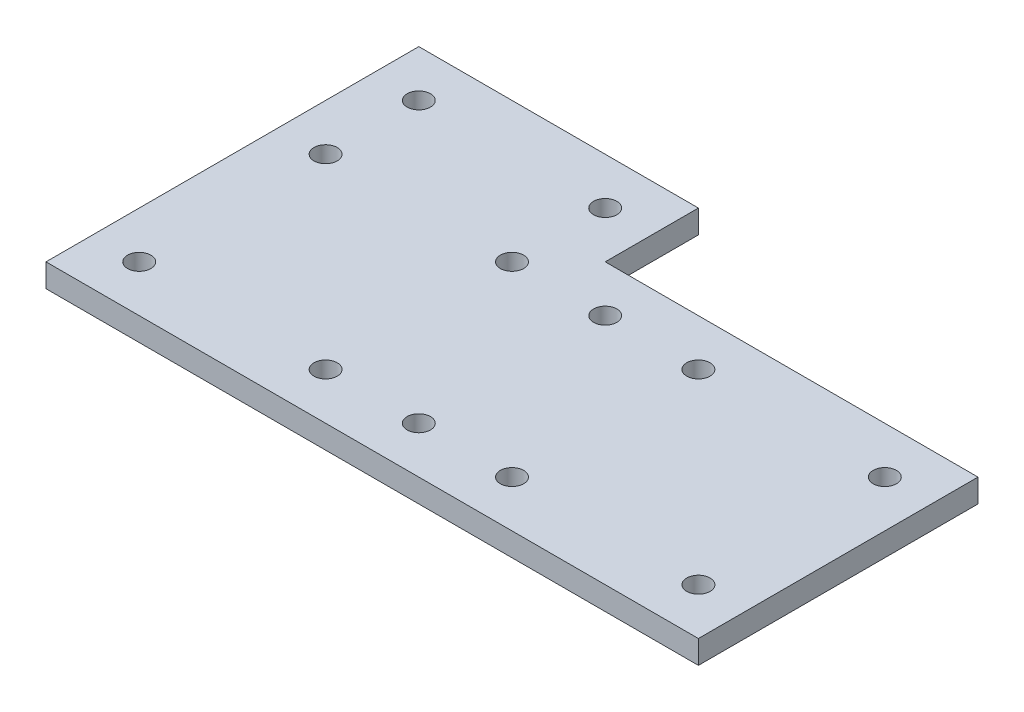
ISO-10303-21;
HEADER;
FILE_DESCRIPTION(('STEP AP214'),'2;1');
FILE_NAME('part.step','',(''),(''),'','','');
FILE_SCHEMA(('AUTOMOTIVE_DESIGN { 1 0 10303 214 1 1 1 1 }'));
ENDSEC;
DATA;
#1=APPLICATION_CONTEXT('core data for automotive mechanical design processes');
#2=APPLICATION_PROTOCOL_DEFINITION('international standard','automotive_design',2000,#1);
#3=PRODUCT_CONTEXT('',#1,'mechanical');
#4=PRODUCT('Part','Part','',(#3));
#5=PRODUCT_RELATED_PRODUCT_CATEGORY('part','',(#4));
#6=PRODUCT_DEFINITION_FORMATION('','',#4);
#7=PRODUCT_DEFINITION_CONTEXT('part definition',#1,'design');
#8=PRODUCT_DEFINITION('design','',#6,#7);
#9=PRODUCT_DEFINITION_SHAPE('','',#8);
#10=(LENGTH_UNIT() NAMED_UNIT(*) SI_UNIT(.MILLI.,.METRE.));
#11=(NAMED_UNIT(*) PLANE_ANGLE_UNIT() SI_UNIT($,.RADIAN.));
#12=(NAMED_UNIT(*) SI_UNIT($,.STERADIAN.) SOLID_ANGLE_UNIT());
#13=UNCERTAINTY_MEASURE_WITH_UNIT(LENGTH_MEASURE(1.E-05),#10,'distance_accuracy_value','');
#14=(GEOMETRIC_REPRESENTATION_CONTEXT(3) GLOBAL_UNCERTAINTY_ASSIGNED_CONTEXT((#13)) GLOBAL_UNIT_ASSIGNED_CONTEXT((#10,
#11,#12)) REPRESENTATION_CONTEXT('',''));
#15=CARTESIAN_POINT('',(0.,0.,0.));
#16=DIRECTION('',(0.,0.,1.));
#17=DIRECTION('',(1.,0.,0.));
#18=AXIS2_PLACEMENT_3D('',#15,#16,#17);
#19=CARTESIAN_POINT('',(38.1,3.175,-50.8));
#20=DIRECTION('',(0.,0.,1.));
#21=DIRECTION('',(1.,0.,0.));
#22=AXIS2_PLACEMENT_3D('',#19,#20,#21);
#23=PLANE('',#22);
#24=DIRECTION('',(-1.,0.,0.));
#25=VECTOR('',#24,1.);
#26=CARTESIAN_POINT('',(38.1,0.,-50.8));
#27=LINE('',#26,#25);
#28=CARTESIAN_POINT('',(38.1,0.,-50.8));
#29=VERTEX_POINT('',#28);
#30=CARTESIAN_POINT('',(0.,0.,-50.8));
#31=VERTEX_POINT('',#30);
#32=EDGE_CURVE('E117',#29,#31,#27,.T.);
#33=ORIENTED_EDGE('',*,*,#32,.T.);
#34=DIRECTION('',(0.,-1.,0.));
#35=VECTOR('',#34,1.);
#36=CARTESIAN_POINT('',(0.,3.175,-50.8));
#37=LINE('',#36,#35);
#38=CARTESIAN_POINT('',(0.,3.175,-50.8));
#39=VERTEX_POINT('',#38);
#40=EDGE_CURVE('E11',#39,#31,#37,.T.);
#41=ORIENTED_EDGE('',*,*,#40,.F.);
#42=DIRECTION('',(-1.,0.,0.));
#43=VECTOR('',#42,1.);
#44=CARTESIAN_POINT('',(38.1,3.175,-50.8));
#45=LINE('',#44,#43);
#46=CARTESIAN_POINT('',(38.1,3.175,-50.8));
#47=VERTEX_POINT('',#46);
#48=EDGE_CURVE('E128',#47,#39,#45,.T.);
#49=ORIENTED_EDGE('',*,*,#48,.F.);
#50=DIRECTION('',(0.,-1.,0.));
#51=VECTOR('',#50,1.);
#52=CARTESIAN_POINT('',(38.1,3.175,-50.8));
#53=LINE('',#52,#51);
#54=EDGE_CURVE('E113',#47,#29,#53,.T.);
#55=ORIENTED_EDGE('',*,*,#54,.T.);
#56=EDGE_LOOP('',(#33,#41,#49,#55));
#57=FACE_BOUND('',#56,.T.);
#58=ADVANCED_FACE('F33',(#57),#23,.F.);
#59=CARTESIAN_POINT('',(0.,3.175,-50.8));
#60=DIRECTION('',(1.,0.,0.));
#61=DIRECTION('',(0.,0.,-1.));
#62=AXIS2_PLACEMENT_3D('',#59,#60,#61);
#63=PLANE('',#62);
#64=DIRECTION('',(0.,0.,1.));
#65=VECTOR('',#64,1.);
#66=CARTESIAN_POINT('',(0.,0.,-50.8));
#67=LINE('',#66,#65);
#68=CARTESIAN_POINT('',(0.,0.,0.));
#69=VERTEX_POINT('',#68);
#70=EDGE_CURVE('E120',#31,#69,#67,.T.);
#71=ORIENTED_EDGE('',*,*,#70,.T.);
#72=DIRECTION('',(0.,-1.,0.));
#73=VECTOR('',#72,1.);
#74=CARTESIAN_POINT('',(0.,3.175,0.));
#75=LINE('',#74,#73);
#76=CARTESIAN_POINT('',(0.,3.175,0.));
#77=VERTEX_POINT('',#76);
#78=EDGE_CURVE('E41',#77,#69,#75,.T.);
#79=ORIENTED_EDGE('',*,*,#78,.F.);
#80=DIRECTION('',(0.,0.,1.));
#81=VECTOR('',#80,1.);
#82=CARTESIAN_POINT('',(0.,3.175,-50.8));
#83=LINE('',#82,#81);
#84=EDGE_CURVE('E86',#39,#77,#83,.T.);
#85=ORIENTED_EDGE('',*,*,#84,.F.);
#86=ORIENTED_EDGE('',*,*,#40,.T.);
#87=EDGE_LOOP('',(#71,#79,#85,#86));
#88=FACE_BOUND('',#87,.T.);
#89=ADVANCED_FACE('F153',(#88),#63,.F.);
#90=CARTESIAN_POINT('',(0.,3.175,0.));
#91=DIRECTION('',(0.,0.,-1.));
#92=DIRECTION('',(-1.,0.,0.));
#93=AXIS2_PLACEMENT_3D('',#90,#91,#92);
#94=PLANE('',#93);
#95=DIRECTION('',(1.,0.,0.));
#96=VECTOR('',#95,1.);
#97=CARTESIAN_POINT('',(0.,0.,0.));
#98=LINE('',#97,#96);
#99=CARTESIAN_POINT('',(88.9,0.,0.));
#100=VERTEX_POINT('',#99);
#101=EDGE_CURVE('E123',#69,#100,#98,.T.);
#102=ORIENTED_EDGE('',*,*,#101,.T.);
#103=DIRECTION('',(0.,-1.,0.));
#104=VECTOR('',#103,1.);
#105=CARTESIAN_POINT('',(88.9,3.175,0.));
#106=LINE('',#105,#104);
#107=CARTESIAN_POINT('',(88.9,3.175,0.));
#108=VERTEX_POINT('',#107);
#109=EDGE_CURVE('E108',#108,#100,#106,.T.);
#110=ORIENTED_EDGE('',*,*,#109,.F.);
#111=DIRECTION('',(1.,0.,0.));
#112=VECTOR('',#111,1.);
#113=CARTESIAN_POINT('',(0.,3.175,0.));
#114=LINE('',#113,#112);
#115=EDGE_CURVE('E99',#77,#108,#114,.T.);
#116=ORIENTED_EDGE('',*,*,#115,.F.);
#117=ORIENTED_EDGE('',*,*,#78,.T.);
#118=EDGE_LOOP('',(#102,#110,#116,#117));
#119=FACE_BOUND('',#118,.T.);
#120=ADVANCED_FACE('F134',(#119),#94,.F.);
#121=CARTESIAN_POINT('',(88.9,3.175,0.));
#122=DIRECTION('',(-1.,0.,0.));
#123=DIRECTION('',(0.,0.,1.));
#124=AXIS2_PLACEMENT_3D('',#121,#122,#123);
#125=PLANE('',#124);
#126=DIRECTION('',(0.,0.,-1.));
#127=VECTOR('',#126,1.);
#128=CARTESIAN_POINT('',(88.9,0.,0.));
#129=LINE('',#128,#127);
#130=CARTESIAN_POINT('',(88.9,0.,-38.1));
#131=VERTEX_POINT('',#130);
#132=EDGE_CURVE('E107',#100,#131,#129,.T.);
#133=ORIENTED_EDGE('',*,*,#132,.T.);
#134=DIRECTION('',(0.,-1.,0.));
#135=VECTOR('',#134,1.);
#136=CARTESIAN_POINT('',(88.9,3.175,-38.1));
#137=LINE('',#136,#135);
#138=CARTESIAN_POINT('',(88.9,3.175,-38.1));
#139=VERTEX_POINT('',#138);
#140=EDGE_CURVE('E104',#139,#131,#137,.T.);
#141=ORIENTED_EDGE('',*,*,#140,.F.);
#142=DIRECTION('',(0.,0.,-1.));
#143=VECTOR('',#142,1.);
#144=CARTESIAN_POINT('',(88.9,3.175,0.));
#145=LINE('',#144,#143);
#146=EDGE_CURVE('E93',#108,#139,#145,.T.);
#147=ORIENTED_EDGE('',*,*,#146,.F.);
#148=ORIENTED_EDGE('',*,*,#109,.T.);
#149=EDGE_LOOP('',(#133,#141,#147,#148));
#150=FACE_BOUND('',#149,.T.);
#151=ADVANCED_FACE('F105',(#150),#125,.F.);
#152=CARTESIAN_POINT('',(88.9,3.175,-38.1));
#153=DIRECTION('',(0.,0.,1.));
#154=DIRECTION('',(1.,0.,0.));
#155=AXIS2_PLACEMENT_3D('',#152,#153,#154);
#156=PLANE('',#155);
#157=DIRECTION('',(-1.,0.,0.));
#158=VECTOR('',#157,1.);
#159=CARTESIAN_POINT('',(88.9,0.,-38.1));
#160=LINE('',#159,#158);
#161=CARTESIAN_POINT('',(38.1,0.,-38.1));
#162=VERTEX_POINT('',#161);
#163=EDGE_CURVE('E72',#131,#162,#160,.T.);
#164=ORIENTED_EDGE('',*,*,#163,.T.);
#165=DIRECTION('',(0.,-1.,0.));
#166=VECTOR('',#165,1.);
#167=CARTESIAN_POINT('',(38.1,3.175,-38.1));
#168=LINE('',#167,#166);
#169=CARTESIAN_POINT('',(38.1,3.175,-38.1));
#170=VERTEX_POINT('',#169);
#171=EDGE_CURVE('E109',#170,#162,#168,.T.);
#172=ORIENTED_EDGE('',*,*,#171,.F.);
#173=DIRECTION('',(-1.,0.,0.));
#174=VECTOR('',#173,1.);
#175=CARTESIAN_POINT('',(88.9,3.175,-38.1));
#176=LINE('',#175,#174);
#177=EDGE_CURVE('E97',#139,#170,#176,.T.);
#178=ORIENTED_EDGE('',*,*,#177,.F.);
#179=ORIENTED_EDGE('',*,*,#140,.T.);
#180=EDGE_LOOP('',(#164,#172,#178,#179));
#181=FACE_BOUND('',#180,.T.);
#182=ADVANCED_FACE('F111',(#181),#156,.F.);
#183=CARTESIAN_POINT('',(38.1,3.175,-38.1));
#184=DIRECTION('',(-1.,0.,0.));
#185=DIRECTION('',(0.,0.,1.));
#186=AXIS2_PLACEMENT_3D('',#183,#184,#185);
#187=PLANE('',#186);
#188=DIRECTION('',(0.,0.,-1.));
#189=VECTOR('',#188,1.);
#190=CARTESIAN_POINT('',(38.1,0.,-38.1));
#191=LINE('',#190,#189);
#192=EDGE_CURVE('E78',#162,#29,#191,.T.);
#193=ORIENTED_EDGE('',*,*,#192,.T.);
#194=ORIENTED_EDGE('',*,*,#54,.F.);
#195=DIRECTION('',(0.,0.,-1.));
#196=VECTOR('',#195,1.);
#197=CARTESIAN_POINT('',(38.1,3.175,-38.1));
#198=LINE('',#197,#196);
#199=EDGE_CURVE('E49',#170,#47,#198,.T.);
#200=ORIENTED_EDGE('',*,*,#199,.F.);
#201=ORIENTED_EDGE('',*,*,#171,.T.);
#202=EDGE_LOOP('',(#193,#194,#200,#201));
#203=FACE_BOUND('',#202,.T.);
#204=ADVANCED_FACE('F141',(#203),#187,.F.);
#205=CARTESIAN_POINT('',(0.,3.175,0.));
#206=DIRECTION('',(0.,1.,0.));
#207=DIRECTION('',(0.,0.,1.));
#208=AXIS2_PLACEMENT_3D('',#205,#206,#207);
#209=PLANE('',#208);
#210=CARTESIAN_POINT('',(57.15,3.175,-31.75));
#211=DIRECTION('',(0.,1.,0.));
#212=DIRECTION('',(0.,0.,1.));
#213=AXIS2_PLACEMENT_3D('',#210,#211,#212);
#214=CIRCLE('',#213,1.5875);
#215=CARTESIAN_POINT('',(57.15,3.175,-30.1625));
#216=VERTEX_POINT('',#215);
#217=EDGE_CURVE('E319',#216,#216,#214,.T.);
#218=ORIENTED_EDGE('',*,*,#217,.F.);
#219=EDGE_LOOP('',(#218));
#220=FACE_BOUND('',#219,.T.);
#221=CARTESIAN_POINT('',(82.55,3.175,-31.75));
#222=DIRECTION('',(0.,1.,0.));
#223=DIRECTION('',(0.,0.,1.));
#224=AXIS2_PLACEMENT_3D('',#221,#222,#223);
#225=CIRCLE('',#224,1.5875);
#226=CARTESIAN_POINT('',(82.55,3.175,-30.1625));
#227=VERTEX_POINT('',#226);
#228=EDGE_CURVE('E322',#227,#227,#225,.T.);
#229=ORIENTED_EDGE('',*,*,#228,.F.);
#230=EDGE_LOOP('',(#229));
#231=FACE_BOUND('',#230,.T.);
#232=CARTESIAN_POINT('',(82.55,3.175,-6.35));
#233=DIRECTION('',(0.,1.,0.));
#234=DIRECTION('',(0.,0.,1.));
#235=AXIS2_PLACEMENT_3D('',#232,#233,#234);
#236=CIRCLE('',#235,1.5875);
#237=CARTESIAN_POINT('',(82.55,3.175,-4.7625));
#238=VERTEX_POINT('',#237);
#239=EDGE_CURVE('E381',#238,#238,#236,.T.);
#240=ORIENTED_EDGE('',*,*,#239,.F.);
#241=EDGE_LOOP('',(#240));
#242=FACE_BOUND('',#241,.T.);
#243=CARTESIAN_POINT('',(31.75,3.175,-6.35));
#244=DIRECTION('',(0.,1.,0.));
#245=DIRECTION('',(0.,0.,1.));
#246=AXIS2_PLACEMENT_3D('',#243,#244,#245);
#247=CIRCLE('',#246,1.5875);
#248=CARTESIAN_POINT('',(31.75,3.175,-4.7625));
#249=VERTEX_POINT('',#248);
#250=EDGE_CURVE('E368',#249,#249,#247,.T.);
#251=ORIENTED_EDGE('',*,*,#250,.F.);
#252=EDGE_LOOP('',(#251));
#253=FACE_BOUND('',#252,.T.);
#254=CARTESIAN_POINT('',(6.35000000000001,3.175,-6.35));
#255=DIRECTION('',(0.,1.,0.));
#256=DIRECTION('',(0.,0.,1.));
#257=AXIS2_PLACEMENT_3D('',#254,#255,#256);
#258=CIRCLE('',#257,1.5875);
#259=CARTESIAN_POINT('',(6.35000000000001,3.175,-4.7625));
#260=VERTEX_POINT('',#259);
#261=EDGE_CURVE('E351',#260,#260,#258,.T.);
#262=ORIENTED_EDGE('',*,*,#261,.F.);
#263=EDGE_LOOP('',(#262));
#264=FACE_BOUND('',#263,.T.);
#265=CARTESIAN_POINT('',(6.35000000000001,3.175,-31.75));
#266=DIRECTION('',(0.,1.,0.));
#267=DIRECTION('',(0.,0.,1.));
#268=AXIS2_PLACEMENT_3D('',#265,#266,#267);
#269=CIRCLE('',#268,1.5875);
#270=CARTESIAN_POINT('',(6.35000000000001,3.175,-30.1625));
#271=VERTEX_POINT('',#270);
#272=EDGE_CURVE('E345',#271,#271,#269,.T.);
#273=ORIENTED_EDGE('',*,*,#272,.F.);
#274=EDGE_LOOP('',(#273));
#275=FACE_BOUND('',#274,.T.);
#276=CARTESIAN_POINT('',(31.75,3.175,-31.75));
#277=DIRECTION('',(0.,1.,0.));
#278=DIRECTION('',(0.,0.,1.));
#279=AXIS2_PLACEMENT_3D('',#276,#277,#278);
#280=CIRCLE('',#279,1.5875);
#281=CARTESIAN_POINT('',(31.75,3.175,-30.1625));
#282=VERTEX_POINT('',#281);
#283=EDGE_CURVE('E339',#282,#282,#280,.T.);
#284=ORIENTED_EDGE('',*,*,#283,.F.);
#285=EDGE_LOOP('',(#284));
#286=FACE_BOUND('',#285,.T.);
#287=CARTESIAN_POINT('',(31.75,3.175,-44.45));
#288=DIRECTION('',(0.,1.,0.));
#289=DIRECTION('',(0.,0.,1.));
#290=AXIS2_PLACEMENT_3D('',#287,#288,#289);
#291=CIRCLE('',#290,1.5875);
#292=CARTESIAN_POINT('',(31.75,3.175,-42.8625));
#293=VERTEX_POINT('',#292);
#294=EDGE_CURVE('E333',#293,#293,#291,.T.);
#295=ORIENTED_EDGE('',*,*,#294,.F.);
#296=EDGE_LOOP('',(#295));
#297=FACE_BOUND('',#296,.T.);
#298=CARTESIAN_POINT('',(57.15,3.175,-6.35));
#299=DIRECTION('',(0.,1.,0.));
#300=DIRECTION('',(0.,0.,1.));
#301=AXIS2_PLACEMENT_3D('',#298,#299,#300);
#302=CIRCLE('',#301,1.5875);
#303=CARTESIAN_POINT('',(57.15,3.175,-4.7625));
#304=VERTEX_POINT('',#303);
#305=EDGE_CURVE('E325',#304,#304,#302,.T.);
#306=ORIENTED_EDGE('',*,*,#305,.F.);
#307=EDGE_LOOP('',(#306));
#308=FACE_BOUND('',#307,.T.);
#309=CARTESIAN_POINT('',(44.45,3.175,-6.35));
#310=DIRECTION('',(0.,1.,0.));
#311=DIRECTION('',(0.,0.,1.));
#312=AXIS2_PLACEMENT_3D('',#309,#310,#311);
#313=CIRCLE('',#312,1.5875);
#314=CARTESIAN_POINT('',(44.45,3.175,-4.7625));
#315=VERTEX_POINT('',#314);
#316=EDGE_CURVE('E408',#315,#315,#313,.T.);
#317=ORIENTED_EDGE('',*,*,#316,.F.);
#318=EDGE_LOOP('',(#317));
#319=FACE_BOUND('',#318,.T.);
#320=CARTESIAN_POINT('',(44.45,3.175,-31.75));
#321=DIRECTION('',(0.,1.,0.));
#322=DIRECTION('',(0.,0.,1.));
#323=AXIS2_PLACEMENT_3D('',#320,#321,#322);
#324=CIRCLE('',#323,1.5875);
#325=CARTESIAN_POINT('',(44.45,3.175,-30.1625));
#326=VERTEX_POINT('',#325);
#327=EDGE_CURVE('E376',#326,#326,#324,.T.);
#328=ORIENTED_EDGE('',*,*,#327,.F.);
#329=EDGE_LOOP('',(#328));
#330=FACE_BOUND('',#329,.T.);
#331=CARTESIAN_POINT('',(6.35,3.175,-44.45));
#332=DIRECTION('',(0.,1.,0.));
#333=DIRECTION('',(0.,0.,1.));
#334=AXIS2_PLACEMENT_3D('',#331,#332,#333);
#335=CIRCLE('',#334,1.5875);
#336=CARTESIAN_POINT('',(6.35,3.175,-42.8625));
#337=VERTEX_POINT('',#336);
#338=EDGE_CURVE('E332',#337,#337,#335,.T.);
#339=ORIENTED_EDGE('',*,*,#338,.F.);
#340=EDGE_LOOP('',(#339));
#341=FACE_BOUND('',#340,.T.);
#342=ORIENTED_EDGE('',*,*,#48,.T.);
#343=ORIENTED_EDGE('',*,*,#84,.T.);
#344=ORIENTED_EDGE('',*,*,#115,.T.);
#345=ORIENTED_EDGE('',*,*,#146,.T.);
#346=ORIENTED_EDGE('',*,*,#177,.T.);
#347=ORIENTED_EDGE('',*,*,#199,.T.);
#348=EDGE_LOOP('',(#342,#343,#344,#345,#346,#347));
#349=FACE_BOUND('',#348,.T.);
#350=ADVANCED_FACE('F95',(#220,#231,#242,#253,#264,#275,#286,#297,#308,#319,#330,#341,#349),
#209,.T.);
#351=CARTESIAN_POINT('',(0.,0.,0.));
#352=DIRECTION('',(0.,1.,0.));
#353=DIRECTION('',(0.,0.,1.));
#354=AXIS2_PLACEMENT_3D('',#351,#352,#353);
#355=PLANE('',#354);
#356=CARTESIAN_POINT('',(57.15,0.,-31.75));
#357=DIRECTION('',(0.,1.,0.));
#358=DIRECTION('',(0.,0.,1.));
#359=AXIS2_PLACEMENT_3D('',#356,#357,#358);
#360=CIRCLE('',#359,1.5875);
#361=CARTESIAN_POINT('',(57.15,0.,-30.1625));
#362=VERTEX_POINT('',#361);
#363=EDGE_CURVE('E316',#362,#362,#360,.T.);
#364=ORIENTED_EDGE('',*,*,#363,.T.);
#365=EDGE_LOOP('',(#364));
#366=FACE_BOUND('',#365,.T.);
#367=CARTESIAN_POINT('',(82.55,0.,-31.75));
#368=DIRECTION('',(0.,1.,0.));
#369=DIRECTION('',(0.,0.,1.));
#370=AXIS2_PLACEMENT_3D('',#367,#368,#369);
#371=CIRCLE('',#370,1.5875);
#372=CARTESIAN_POINT('',(82.55,0.,-30.1625));
#373=VERTEX_POINT('',#372);
#374=EDGE_CURVE('E384',#373,#373,#371,.T.);
#375=ORIENTED_EDGE('',*,*,#374,.T.);
#376=EDGE_LOOP('',(#375));
#377=FACE_BOUND('',#376,.T.);
#378=CARTESIAN_POINT('',(82.55,0.,-6.35));
#379=DIRECTION('',(0.,1.,0.));
#380=DIRECTION('',(0.,0.,1.));
#381=AXIS2_PLACEMENT_3D('',#378,#379,#380);
#382=CIRCLE('',#381,1.5875);
#383=CARTESIAN_POINT('',(82.55,0.,-4.7625));
#384=VERTEX_POINT('',#383);
#385=EDGE_CURVE('E373',#384,#384,#382,.T.);
#386=ORIENTED_EDGE('',*,*,#385,.T.);
#387=EDGE_LOOP('',(#386));
#388=FACE_BOUND('',#387,.T.);
#389=CARTESIAN_POINT('',(31.75,0.,-6.35));
#390=DIRECTION('',(0.,1.,0.));
#391=DIRECTION('',(0.,0.,1.));
#392=AXIS2_PLACEMENT_3D('',#389,#390,#391);
#393=CIRCLE('',#392,1.5875);
#394=CARTESIAN_POINT('',(31.75,0.,-4.7625));
#395=VERTEX_POINT('',#394);
#396=EDGE_CURVE('E354',#395,#395,#393,.T.);
#397=ORIENTED_EDGE('',*,*,#396,.T.);
#398=EDGE_LOOP('',(#397));
#399=FACE_BOUND('',#398,.T.);
#400=CARTESIAN_POINT('',(6.35000000000001,0.,-6.35));
#401=DIRECTION('',(0.,1.,0.));
#402=DIRECTION('',(0.,0.,1.));
#403=AXIS2_PLACEMENT_3D('',#400,#401,#402);
#404=CIRCLE('',#403,1.5875);
#405=CARTESIAN_POINT('',(6.35000000000001,0.,-4.7625));
#406=VERTEX_POINT('',#405);
#407=EDGE_CURVE('E348',#406,#406,#404,.T.);
#408=ORIENTED_EDGE('',*,*,#407,.T.);
#409=EDGE_LOOP('',(#408));
#410=FACE_BOUND('',#409,.T.);
#411=CARTESIAN_POINT('',(6.35000000000001,0.,-31.75));
#412=DIRECTION('',(0.,1.,0.));
#413=DIRECTION('',(0.,0.,1.));
#414=AXIS2_PLACEMENT_3D('',#411,#412,#413);
#415=CIRCLE('',#414,1.5875);
#416=CARTESIAN_POINT('',(6.35000000000001,0.,-30.1625));
#417=VERTEX_POINT('',#416);
#418=EDGE_CURVE('E342',#417,#417,#415,.T.);
#419=ORIENTED_EDGE('',*,*,#418,.T.);
#420=EDGE_LOOP('',(#419));
#421=FACE_BOUND('',#420,.T.);
#422=CARTESIAN_POINT('',(31.75,0.,-31.75));
#423=DIRECTION('',(0.,1.,0.));
#424=DIRECTION('',(0.,0.,1.));
#425=AXIS2_PLACEMENT_3D('',#422,#423,#424);
#426=CIRCLE('',#425,1.5875);
#427=CARTESIAN_POINT('',(31.75,0.,-30.1625));
#428=VERTEX_POINT('',#427);
#429=EDGE_CURVE('E336',#428,#428,#426,.T.);
#430=ORIENTED_EDGE('',*,*,#429,.T.);
#431=EDGE_LOOP('',(#430));
#432=FACE_BOUND('',#431,.T.);
#433=CARTESIAN_POINT('',(31.75,0.,-44.45));
#434=DIRECTION('',(0.,1.,0.));
#435=DIRECTION('',(0.,0.,1.));
#436=AXIS2_PLACEMENT_3D('',#433,#434,#435);
#437=CIRCLE('',#436,1.5875);
#438=CARTESIAN_POINT('',(31.75,0.,-42.8625));
#439=VERTEX_POINT('',#438);
#440=EDGE_CURVE('E329',#439,#439,#437,.T.);
#441=ORIENTED_EDGE('',*,*,#440,.T.);
#442=EDGE_LOOP('',(#441));
#443=FACE_BOUND('',#442,.T.);
#444=CARTESIAN_POINT('',(57.15,0.,-6.35));
#445=DIRECTION('',(0.,1.,0.));
#446=DIRECTION('',(0.,0.,1.));
#447=AXIS2_PLACEMENT_3D('',#444,#445,#446);
#448=CIRCLE('',#447,1.5875);
#449=CARTESIAN_POINT('',(57.15,0.,-4.7625));
#450=VERTEX_POINT('',#449);
#451=EDGE_CURVE('E320',#450,#450,#448,.T.);
#452=ORIENTED_EDGE('',*,*,#451,.T.);
#453=EDGE_LOOP('',(#452));
#454=FACE_BOUND('',#453,.T.);
#455=CARTESIAN_POINT('',(44.45,0.,-6.35));
#456=DIRECTION('',(0.,1.,0.));
#457=DIRECTION('',(0.,0.,1.));
#458=AXIS2_PLACEMENT_3D('',#455,#456,#457);
#459=CIRCLE('',#458,1.5875);
#460=CARTESIAN_POINT('',(44.45,0.,-4.7625));
#461=VERTEX_POINT('',#460);
#462=EDGE_CURVE('E416',#461,#461,#459,.T.);
#463=ORIENTED_EDGE('',*,*,#462,.T.);
#464=EDGE_LOOP('',(#463));
#465=FACE_BOUND('',#464,.T.);
#466=CARTESIAN_POINT('',(44.45,0.,-31.75));
#467=DIRECTION('',(0.,1.,0.));
#468=DIRECTION('',(0.,0.,1.));
#469=AXIS2_PLACEMENT_3D('',#466,#467,#468);
#470=CIRCLE('',#469,1.5875);
#471=CARTESIAN_POINT('',(44.45,0.,-30.1625));
#472=VERTEX_POINT('',#471);
#473=EDGE_CURVE('E412',#472,#472,#470,.T.);
#474=ORIENTED_EDGE('',*,*,#473,.T.);
#475=EDGE_LOOP('',(#474));
#476=FACE_BOUND('',#475,.T.);
#477=CARTESIAN_POINT('',(6.35,0.,-44.45));
#478=DIRECTION('',(0.,1.,0.));
#479=DIRECTION('',(0.,0.,1.));
#480=AXIS2_PLACEMENT_3D('',#477,#478,#479);
#481=CIRCLE('',#480,1.5875);
#482=CARTESIAN_POINT('',(6.35,0.,-42.8625));
#483=VERTEX_POINT('',#482);
#484=EDGE_CURVE('E121',#483,#483,#481,.T.);
#485=ORIENTED_EDGE('',*,*,#484,.T.);
#486=EDGE_LOOP('',(#485));
#487=FACE_BOUND('',#486,.T.);
#488=ORIENTED_EDGE('',*,*,#32,.F.);
#489=ORIENTED_EDGE('',*,*,#192,.F.);
#490=ORIENTED_EDGE('',*,*,#163,.F.);
#491=ORIENTED_EDGE('',*,*,#132,.F.);
#492=ORIENTED_EDGE('',*,*,#101,.F.);
#493=ORIENTED_EDGE('',*,*,#70,.F.);
#494=EDGE_LOOP('',(#488,#489,#490,#491,#492,#493));
#495=FACE_BOUND('',#494,.T.);
#496=ADVANCED_FACE('F137',(#366,#377,#388,#399,#410,#421,#432,#443,#454,#465,#476,#487,#495),
#355,.F.);
#497=CARTESIAN_POINT('',(6.35,0.,-44.45));
#498=DIRECTION('',(0.,1.,0.));
#499=DIRECTION('',(0.,0.,1.));
#500=AXIS2_PLACEMENT_3D('',#497,#498,#499);
#501=CYLINDRICAL_SURFACE('',#500,1.5875);
#502=ORIENTED_EDGE('',*,*,#484,.F.);
#503=EDGE_LOOP('',(#502));
#504=FACE_BOUND('',#503,.T.);
#505=ORIENTED_EDGE('',*,*,#338,.T.);
#506=EDGE_LOOP('',(#505));
#507=FACE_BOUND('',#506,.T.);
#508=ADVANCED_FACE('F190',(#504,#507),#501,.F.);
#509=CARTESIAN_POINT('',(44.45,0.,-31.75));
#510=DIRECTION('',(0.,1.,0.));
#511=DIRECTION('',(0.,0.,1.));
#512=AXIS2_PLACEMENT_3D('',#509,#510,#511);
#513=CYLINDRICAL_SURFACE('',#512,1.5875);
#514=ORIENTED_EDGE('',*,*,#473,.F.);
#515=EDGE_LOOP('',(#514));
#516=FACE_BOUND('',#515,.T.);
#517=ORIENTED_EDGE('',*,*,#327,.T.);
#518=EDGE_LOOP('',(#517));
#519=FACE_BOUND('',#518,.T.);
#520=ADVANCED_FACE('F199',(#516,#519),#513,.F.);
#521=CARTESIAN_POINT('',(44.45,0.,-6.35));
#522=DIRECTION('',(0.,1.,0.));
#523=DIRECTION('',(0.,0.,1.));
#524=AXIS2_PLACEMENT_3D('',#521,#522,#523);
#525=CYLINDRICAL_SURFACE('',#524,1.5875);
#526=ORIENTED_EDGE('',*,*,#462,.F.);
#527=EDGE_LOOP('',(#526));
#528=FACE_BOUND('',#527,.T.);
#529=ORIENTED_EDGE('',*,*,#316,.T.);
#530=EDGE_LOOP('',(#529));
#531=FACE_BOUND('',#530,.T.);
#532=ADVANCED_FACE('F209',(#528,#531),#525,.F.);
#533=CARTESIAN_POINT('',(57.15,0.,-6.35));
#534=DIRECTION('',(0.,1.,0.));
#535=DIRECTION('',(0.,0.,1.));
#536=AXIS2_PLACEMENT_3D('',#533,#534,#535);
#537=CYLINDRICAL_SURFACE('',#536,1.5875);
#538=ORIENTED_EDGE('',*,*,#451,.F.);
#539=EDGE_LOOP('',(#538));
#540=FACE_BOUND('',#539,.T.);
#541=ORIENTED_EDGE('',*,*,#305,.T.);
#542=EDGE_LOOP('',(#541));
#543=FACE_BOUND('',#542,.T.);
#544=ADVANCED_FACE('F219',(#540,#543),#537,.F.);
#545=CARTESIAN_POINT('',(31.75,0.,-44.45));
#546=DIRECTION('',(0.,1.,0.));
#547=DIRECTION('',(0.,0.,1.));
#548=AXIS2_PLACEMENT_3D('',#545,#546,#547);
#549=CYLINDRICAL_SURFACE('',#548,1.5875);
#550=ORIENTED_EDGE('',*,*,#440,.F.);
#551=EDGE_LOOP('',(#550));
#552=FACE_BOUND('',#551,.T.);
#553=ORIENTED_EDGE('',*,*,#294,.T.);
#554=EDGE_LOOP('',(#553));
#555=FACE_BOUND('',#554,.T.);
#556=ADVANCED_FACE('F229',(#552,#555),#549,.F.);
#557=CARTESIAN_POINT('',(31.75,0.,-31.75));
#558=DIRECTION('',(0.,1.,0.));
#559=DIRECTION('',(0.,0.,1.));
#560=AXIS2_PLACEMENT_3D('',#557,#558,#559);
#561=CYLINDRICAL_SURFACE('',#560,1.5875);
#562=ORIENTED_EDGE('',*,*,#429,.F.);
#563=EDGE_LOOP('',(#562));
#564=FACE_BOUND('',#563,.T.);
#565=ORIENTED_EDGE('',*,*,#283,.T.);
#566=EDGE_LOOP('',(#565));
#567=FACE_BOUND('',#566,.T.);
#568=ADVANCED_FACE('F239',(#564,#567),#561,.F.);
#569=CARTESIAN_POINT('',(6.35000000000001,0.,-31.75));
#570=DIRECTION('',(0.,1.,0.));
#571=DIRECTION('',(0.,0.,1.));
#572=AXIS2_PLACEMENT_3D('',#569,#570,#571);
#573=CYLINDRICAL_SURFACE('',#572,1.5875);
#574=ORIENTED_EDGE('',*,*,#418,.F.);
#575=EDGE_LOOP('',(#574));
#576=FACE_BOUND('',#575,.T.);
#577=ORIENTED_EDGE('',*,*,#272,.T.);
#578=EDGE_LOOP('',(#577));
#579=FACE_BOUND('',#578,.T.);
#580=ADVANCED_FACE('F249',(#576,#579),#573,.F.);
#581=CARTESIAN_POINT('',(6.35000000000001,0.,-6.35));
#582=DIRECTION('',(0.,1.,0.));
#583=DIRECTION('',(0.,0.,1.));
#584=AXIS2_PLACEMENT_3D('',#581,#582,#583);
#585=CYLINDRICAL_SURFACE('',#584,1.5875);
#586=ORIENTED_EDGE('',*,*,#407,.F.);
#587=EDGE_LOOP('',(#586));
#588=FACE_BOUND('',#587,.T.);
#589=ORIENTED_EDGE('',*,*,#261,.T.);
#590=EDGE_LOOP('',(#589));
#591=FACE_BOUND('',#590,.T.);
#592=ADVANCED_FACE('F259',(#588,#591),#585,.F.);
#593=CARTESIAN_POINT('',(31.75,0.,-6.35));
#594=DIRECTION('',(0.,1.,0.));
#595=DIRECTION('',(0.,0.,1.));
#596=AXIS2_PLACEMENT_3D('',#593,#594,#595);
#597=CYLINDRICAL_SURFACE('',#596,1.5875);
#598=ORIENTED_EDGE('',*,*,#396,.F.);
#599=EDGE_LOOP('',(#598));
#600=FACE_BOUND('',#599,.T.);
#601=ORIENTED_EDGE('',*,*,#250,.T.);
#602=EDGE_LOOP('',(#601));
#603=FACE_BOUND('',#602,.T.);
#604=ADVANCED_FACE('F269',(#600,#603),#597,.F.);
#605=CARTESIAN_POINT('',(82.55,0.,-6.35));
#606=DIRECTION('',(0.,1.,0.));
#607=DIRECTION('',(0.,0.,1.));
#608=AXIS2_PLACEMENT_3D('',#605,#606,#607);
#609=CYLINDRICAL_SURFACE('',#608,1.5875);
#610=ORIENTED_EDGE('',*,*,#385,.F.);
#611=EDGE_LOOP('',(#610));
#612=FACE_BOUND('',#611,.T.);
#613=ORIENTED_EDGE('',*,*,#239,.T.);
#614=EDGE_LOOP('',(#613));
#615=FACE_BOUND('',#614,.T.);
#616=ADVANCED_FACE('F279',(#612,#615),#609,.F.);
#617=CARTESIAN_POINT('',(82.55,0.,-31.75));
#618=DIRECTION('',(0.,1.,0.));
#619=DIRECTION('',(0.,0.,1.));
#620=AXIS2_PLACEMENT_3D('',#617,#618,#619);
#621=CYLINDRICAL_SURFACE('',#620,1.5875);
#622=ORIENTED_EDGE('',*,*,#374,.F.);
#623=EDGE_LOOP('',(#622));
#624=FACE_BOUND('',#623,.T.);
#625=ORIENTED_EDGE('',*,*,#228,.T.);
#626=EDGE_LOOP('',(#625));
#627=FACE_BOUND('',#626,.T.);
#628=ADVANCED_FACE('F289',(#624,#627),#621,.F.);
#629=CARTESIAN_POINT('',(57.15,0.,-31.75));
#630=DIRECTION('',(0.,1.,0.));
#631=DIRECTION('',(0.,0.,1.));
#632=AXIS2_PLACEMENT_3D('',#629,#630,#631);
#633=CYLINDRICAL_SURFACE('',#632,1.5875);
#634=ORIENTED_EDGE('',*,*,#363,.F.);
#635=EDGE_LOOP('',(#634));
#636=FACE_BOUND('',#635,.T.);
#637=ORIENTED_EDGE('',*,*,#217,.T.);
#638=EDGE_LOOP('',(#637));
#639=FACE_BOUND('',#638,.T.);
#640=ADVANCED_FACE('F299',(#636,#639),#633,.F.);
#641=CLOSED_SHELL('',(#58,#89,#120,#151,#182,#204,#350,#496,#508,#520,#532,#544,#556,#568,#580,
#592,#604,#616,#628,#640));
#642=MANIFOLD_SOLID_BREP('B2',#641);
#643=ADVANCED_BREP_SHAPE_REPRESENTATION('',(#18,#642),#14);
#644=SHAPE_DEFINITION_REPRESENTATION(#9,#643);
ENDSEC;
END-ISO-10303-21;
